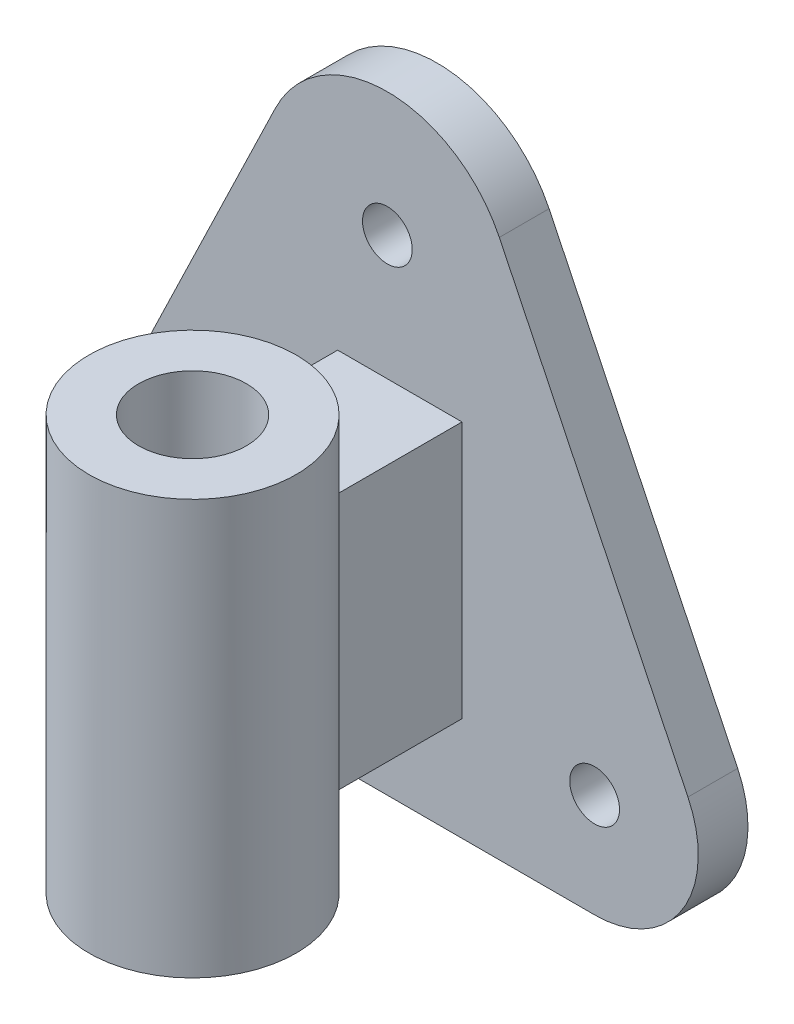
ISO-10303-21;
HEADER;
FILE_DESCRIPTION(('STEP AP214'),'2;1');
FILE_NAME('part.step','',(''),(''),'','','');
FILE_SCHEMA(('AUTOMOTIVE_DESIGN { 1 0 10303 214 1 1 1 1 }'));
ENDSEC;
DATA;
#1=APPLICATION_CONTEXT('core data for automotive mechanical design processes');
#2=APPLICATION_PROTOCOL_DEFINITION('international standard','automotive_design',2000,#1);
#3=PRODUCT_CONTEXT('',#1,'mechanical');
#4=PRODUCT('Part','Part','',(#3));
#5=PRODUCT_RELATED_PRODUCT_CATEGORY('part','',(#4));
#6=PRODUCT_DEFINITION_FORMATION('','',#4);
#7=PRODUCT_DEFINITION_CONTEXT('part definition',#1,'design');
#8=PRODUCT_DEFINITION('design','',#6,#7);
#9=PRODUCT_DEFINITION_SHAPE('','',#8);
#10=(LENGTH_UNIT() NAMED_UNIT(*) SI_UNIT(.MILLI.,.METRE.));
#11=(NAMED_UNIT(*) PLANE_ANGLE_UNIT() SI_UNIT($,.RADIAN.));
#12=(NAMED_UNIT(*) SI_UNIT($,.STERADIAN.) SOLID_ANGLE_UNIT());
#13=UNCERTAINTY_MEASURE_WITH_UNIT(LENGTH_MEASURE(1.E-05),#10,'distance_accuracy_value','');
#14=(GEOMETRIC_REPRESENTATION_CONTEXT(3) GLOBAL_UNCERTAINTY_ASSIGNED_CONTEXT((#13)) GLOBAL_UNIT_ASSIGNED_CONTEXT((#10,
#11,#12)) REPRESENTATION_CONTEXT('',''));
#15=CARTESIAN_POINT('',(0.,0.,0.));
#16=DIRECTION('',(0.,0.,1.));
#17=DIRECTION('',(1.,0.,0.));
#18=AXIS2_PLACEMENT_3D('',#15,#16,#17);
#19=CARTESIAN_POINT('',(0.,87.,0.));
#20=DIRECTION('',(0.,-1.,0.));
#21=DIRECTION('',(0.,0.,-1.));
#22=AXIS2_PLACEMENT_3D('',#19,#20,#21);
#23=PLANE('',#22);
#24=CARTESIAN_POINT('',(92.8513576072551,87.,62.));
#25=DIRECTION('',(0.,1.,0.));
#26=DIRECTION('',(0.,0.,1.));
#27=AXIS2_PLACEMENT_3D('',#24,#25,#26);
#28=CIRCLE('',#27,25.);
#29=CARTESIAN_POINT('',(107.851357607255,87.,42.));
#30=VERTEX_POINT('',#29);
#31=CARTESIAN_POINT('',(77.8513576072551,87.,42.));
#32=VERTEX_POINT('',#31);
#33=EDGE_CURVE('E135',#30,#32,#28,.T.);
#34=ORIENTED_EDGE('',*,*,#33,.F.);
#35=DIRECTION('',(0.,0.,-1.));
#36=VECTOR('',#35,1.);
#37=CARTESIAN_POINT('',(107.851357607255,87.,0.));
#38=LINE('',#37,#36);
#39=CARTESIAN_POINT('',(107.851357607255,87.,12.));
#40=VERTEX_POINT('',#39);
#41=EDGE_CURVE('E138',#30,#40,#38,.T.);
#42=ORIENTED_EDGE('',*,*,#41,.T.);
#43=DIRECTION('',(1.,0.,0.));
#44=VECTOR('',#43,1.);
#45=CARTESIAN_POINT('',(0.,87.,12.));
#46=LINE('',#45,#44);
#47=CARTESIAN_POINT('',(77.8513576072551,87.,12.));
#48=VERTEX_POINT('',#47);
#49=EDGE_CURVE('E73',#48,#40,#46,.T.);
#50=ORIENTED_EDGE('',*,*,#49,.F.);
#51=DIRECTION('',(0.,0.,-1.));
#52=VECTOR('',#51,1.);
#53=CARTESIAN_POINT('',(77.8513576072551,87.,0.));
#54=LINE('',#53,#52);
#55=EDGE_CURVE('E132',#32,#48,#54,.T.);
#56=ORIENTED_EDGE('',*,*,#55,.F.);
#57=EDGE_LOOP('',(#34,#42,#50,#56));
#58=FACE_BOUND('',#57,.T.);
#59=ADVANCED_FACE('F58',(#58),#23,.F.);
#60=CARTESIAN_POINT('',(0.,25.,0.));
#61=DIRECTION('',(0.,-1.,0.));
#62=DIRECTION('',(0.,0.,-1.));
#63=AXIS2_PLACEMENT_3D('',#60,#61,#62);
#64=PLANE('',#63);
#65=DIRECTION('',(0.,0.,-1.));
#66=VECTOR('',#65,1.);
#67=CARTESIAN_POINT('',(107.851357607255,25.,0.));
#68=LINE('',#67,#66);
#69=CARTESIAN_POINT('',(107.851357607255,25.,42.));
#70=VERTEX_POINT('',#69);
#71=CARTESIAN_POINT('',(107.851357607255,25.,12.));
#72=VERTEX_POINT('',#71);
#73=EDGE_CURVE('E168',#70,#72,#68,.T.);
#74=ORIENTED_EDGE('',*,*,#73,.F.);
#75=CARTESIAN_POINT('',(92.8513576072551,25.,62.));
#76=DIRECTION('',(0.,-1.,0.));
#77=DIRECTION('',(0.,0.,-1.));
#78=AXIS2_PLACEMENT_3D('',#75,#76,#77);
#79=CIRCLE('',#78,25.);
#80=CARTESIAN_POINT('',(77.8513576072551,25.,42.));
#81=VERTEX_POINT('',#80);
#82=EDGE_CURVE('E164',#81,#70,#79,.T.);
#83=ORIENTED_EDGE('',*,*,#82,.F.);
#84=DIRECTION('',(0.,0.,-1.));
#85=VECTOR('',#84,1.);
#86=CARTESIAN_POINT('',(77.8513576072551,25.,0.));
#87=LINE('',#86,#85);
#88=CARTESIAN_POINT('',(77.8513576072551,25.,12.));
#89=VERTEX_POINT('',#88);
#90=EDGE_CURVE('E145',#81,#89,#87,.T.);
#91=ORIENTED_EDGE('',*,*,#90,.T.);
#92=DIRECTION('',(1.,0.,0.));
#93=VECTOR('',#92,1.);
#94=CARTESIAN_POINT('',(0.,25.,12.));
#95=LINE('',#94,#93);
#96=EDGE_CURVE('E170',#89,#72,#95,.T.);
#97=ORIENTED_EDGE('',*,*,#96,.T.);
#98=EDGE_LOOP('',(#74,#83,#91,#97));
#99=FACE_BOUND('',#98,.T.);
#100=ADVANCED_FACE('F284',(#99),#64,.T.);
#101=CARTESIAN_POINT('',(139.842699598597,25.,12.));
#102=DIRECTION('',(0.,0.,1.));
#103=DIRECTION('',(1.,0.,0.));
#104=AXIS2_PLACEMENT_3D('',#101,#102,#103);
#105=PLANE('',#104);
#106=CARTESIAN_POINT('',(89.8426995985971,117.,12.));
#107=DIRECTION('',(0.,0.,1.));
#108=DIRECTION('',(1.,0.,0.));
#109=AXIS2_PLACEMENT_3D('',#106,#107,#108);
#110=CIRCLE('',#109,6.);
#111=CARTESIAN_POINT('',(95.8426995985971,117.,12.));
#112=VERTEX_POINT('',#111);
#113=EDGE_CURVE('E189',#112,#112,#110,.T.);
#114=ORIENTED_EDGE('',*,*,#113,.F.);
#115=EDGE_LOOP('',(#114));
#116=FACE_BOUND('',#115,.T.);
#117=CARTESIAN_POINT('',(139.842699598597,25.,12.));
#118=DIRECTION('',(0.,0.,1.));
#119=DIRECTION('',(1.,0.,0.));
#120=AXIS2_PLACEMENT_3D('',#117,#118,#119);
#121=CIRCLE('',#120,25.);
#122=CARTESIAN_POINT('',(139.842699598597,0.,12.));
#123=VERTEX_POINT('',#122);
#124=CARTESIAN_POINT('',(162.353302591837,35.8753277137172,12.));
#125=VERTEX_POINT('',#124);
#126=EDGE_CURVE('E201',#123,#125,#121,.T.);
#127=ORIENTED_EDGE('',*,*,#126,.T.);
#128=DIRECTION('',(-0.43501310854869,0.900424119729589,0.));
#129=VECTOR('',#128,1.);
#130=CARTESIAN_POINT('',(116.855423190485,130.050393256461,12.));
#131=LINE('',#130,#129);
#132=CARTESIAN_POINT('',(116.855423190485,130.050393256461,12.));
#133=VERTEX_POINT('',#132);
#134=EDGE_CURVE('E204',#125,#133,#131,.T.);
#135=ORIENTED_EDGE('',*,*,#134,.T.);
#136=CARTESIAN_POINT('',(89.8426995985971,117.,12.));
#137=DIRECTION('',(0.,0.,1.));
#138=DIRECTION('',(1.,0.,0.));
#139=AXIS2_PLACEMENT_3D('',#136,#137,#138);
#140=CIRCLE('',#139,30.);
#141=CARTESIAN_POINT('',(62.8299760067094,130.050393256461,12.));
#142=VERTEX_POINT('',#141);
#143=EDGE_CURVE('E207',#133,#142,#140,.T.);
#144=ORIENTED_EDGE('',*,*,#143,.T.);
#145=DIRECTION('',(-0.43501310854869,-0.900424119729589,0.));
#146=VECTOR('',#145,1.);
#147=CARTESIAN_POINT('',(17.3320966053574,35.8753277137172,12.));
#148=LINE('',#147,#146);
#149=CARTESIAN_POINT('',(17.3320966053574,35.8753277137172,12.));
#150=VERTEX_POINT('',#149);
#151=EDGE_CURVE('E209',#142,#150,#148,.T.);
#152=ORIENTED_EDGE('',*,*,#151,.T.);
#153=CARTESIAN_POINT('',(39.8426995985971,25.,12.));
#154=DIRECTION('',(0.,0.,1.));
#155=DIRECTION('',(-1.,0.,0.));
#156=AXIS2_PLACEMENT_3D('',#153,#154,#155);
#157=CIRCLE('',#156,25.);
#158=CARTESIAN_POINT('',(39.8426995985971,0.,12.));
#159=VERTEX_POINT('',#158);
#160=EDGE_CURVE('E211',#150,#159,#157,.T.);
#161=ORIENTED_EDGE('',*,*,#160,.T.);
#162=DIRECTION('',(1.,0.,0.));
#163=VECTOR('',#162,1.);
#164=CARTESIAN_POINT('',(39.8426995985971,0.,12.));
#165=LINE('',#164,#163);
#166=EDGE_CURVE('E213',#159,#123,#165,.T.);
#167=ORIENTED_EDGE('',*,*,#166,.T.);
#168=EDGE_LOOP('',(#127,#135,#144,#152,#161,#167));
#169=FACE_BOUND('',#168,.T.);
#170=CARTESIAN_POINT('',(39.8426995985971,25.,12.));
#171=DIRECTION('',(0.,0.,1.));
#172=DIRECTION('',(1.,0.,0.));
#173=AXIS2_PLACEMENT_3D('',#170,#171,#172);
#174=CIRCLE('',#173,6.);
#175=CARTESIAN_POINT('',(45.8426995985971,25.,12.));
#176=VERTEX_POINT('',#175);
#177=EDGE_CURVE('E195',#176,#176,#174,.T.);
#178=ORIENTED_EDGE('',*,*,#177,.F.);
#179=EDGE_LOOP('',(#178));
#180=FACE_BOUND('',#179,.T.);
#181=CARTESIAN_POINT('',(139.842699598597,25.,12.));
#182=DIRECTION('',(0.,0.,1.));
#183=DIRECTION('',(1.,0.,0.));
#184=AXIS2_PLACEMENT_3D('',#181,#182,#183);
#185=CIRCLE('',#184,6.00000000000002);
#186=CARTESIAN_POINT('',(145.842699598597,25.,12.));
#187=VERTEX_POINT('',#186);
#188=EDGE_CURVE('E183',#187,#187,#185,.T.);
#189=ORIENTED_EDGE('',*,*,#188,.F.);
#190=EDGE_LOOP('',(#189));
#191=FACE_BOUND('',#190,.T.);
#192=DIRECTION('',(0.,-1.,0.));
#193=VECTOR('',#192,1.);
#194=CARTESIAN_POINT('',(77.8513576072551,87.,12.));
#195=LINE('',#194,#193);
#196=EDGE_CURVE('E78',#48,#89,#195,.T.);
#197=ORIENTED_EDGE('',*,*,#196,.F.);
#198=ORIENTED_EDGE('',*,*,#49,.T.);
#199=DIRECTION('',(0.,-1.,0.));
#200=VECTOR('',#199,1.);
#201=CARTESIAN_POINT('',(107.851357607255,87.,12.));
#202=LINE('',#201,#200);
#203=EDGE_CURVE('E178',#40,#72,#202,.T.);
#204=ORIENTED_EDGE('',*,*,#203,.T.);
#205=ORIENTED_EDGE('',*,*,#96,.F.);
#206=EDGE_LOOP('',(#197,#198,#204,#205));
#207=FACE_BOUND('',#206,.T.);
#208=ADVANCED_FACE('F262',(#116,#169,#180,#191,#207),#105,.T.);
#209=CARTESIAN_POINT('',(139.842699598597,25.,0.));
#210=DIRECTION('',(0.,0.,1.));
#211=DIRECTION('',(1.,0.,0.));
#212=AXIS2_PLACEMENT_3D('',#209,#210,#211);
#213=PLANE('',#212);
#214=CARTESIAN_POINT('',(139.842699598597,25.,0.));
#215=DIRECTION('',(0.,0.,1.));
#216=DIRECTION('',(1.,0.,0.));
#217=AXIS2_PLACEMENT_3D('',#214,#215,#216);
#218=CIRCLE('',#217,25.);
#219=CARTESIAN_POINT('',(139.842699598597,0.,0.));
#220=VERTEX_POINT('',#219);
#221=CARTESIAN_POINT('',(162.353302591837,35.8753277137172,0.));
#222=VERTEX_POINT('',#221);
#223=EDGE_CURVE('E198',#220,#222,#218,.T.);
#224=ORIENTED_EDGE('',*,*,#223,.F.);
#225=DIRECTION('',(1.,0.,0.));
#226=VECTOR('',#225,1.);
#227=CARTESIAN_POINT('',(39.8426995985971,0.,0.));
#228=LINE('',#227,#226);
#229=CARTESIAN_POINT('',(39.8426995985971,0.,0.));
#230=VERTEX_POINT('',#229);
#231=EDGE_CURVE('E205',#230,#220,#228,.T.);
#232=ORIENTED_EDGE('',*,*,#231,.F.);
#233=CARTESIAN_POINT('',(39.8426995985971,25.,0.));
#234=DIRECTION('',(0.,0.,1.));
#235=DIRECTION('',(-1.,0.,0.));
#236=AXIS2_PLACEMENT_3D('',#233,#234,#235);
#237=CIRCLE('',#236,25.);
#238=CARTESIAN_POINT('',(17.3320966053574,35.8753277137172,0.));
#239=VERTEX_POINT('',#238);
#240=EDGE_CURVE('E224',#239,#230,#237,.T.);
#241=ORIENTED_EDGE('',*,*,#240,.F.);
#242=DIRECTION('',(-0.43501310854869,-0.900424119729589,0.));
#243=VECTOR('',#242,1.);
#244=CARTESIAN_POINT('',(17.3320966053574,35.8753277137172,0.));
#245=LINE('',#244,#243);
#246=CARTESIAN_POINT('',(62.8299760067094,130.050393256461,0.));
#247=VERTEX_POINT('',#246);
#248=EDGE_CURVE('E222',#247,#239,#245,.T.);
#249=ORIENTED_EDGE('',*,*,#248,.F.);
#250=CARTESIAN_POINT('',(89.8426995985971,117.,0.));
#251=DIRECTION('',(0.,0.,1.));
#252=DIRECTION('',(1.,0.,0.));
#253=AXIS2_PLACEMENT_3D('',#250,#251,#252);
#254=CIRCLE('',#253,30.);
#255=CARTESIAN_POINT('',(116.855423190485,130.050393256461,0.));
#256=VERTEX_POINT('',#255);
#257=EDGE_CURVE('E220',#256,#247,#254,.T.);
#258=ORIENTED_EDGE('',*,*,#257,.F.);
#259=DIRECTION('',(-0.43501310854869,0.900424119729589,0.));
#260=VECTOR('',#259,1.);
#261=CARTESIAN_POINT('',(116.855423190485,130.050393256461,0.));
#262=LINE('',#261,#260);
#263=EDGE_CURVE('E218',#222,#256,#262,.T.);
#264=ORIENTED_EDGE('',*,*,#263,.F.);
#265=EDGE_LOOP('',(#224,#232,#241,#249,#258,#264));
#266=FACE_BOUND('',#265,.T.);
#267=CARTESIAN_POINT('',(39.8426995985971,25.,0.));
#268=DIRECTION('',(0.,0.,1.));
#269=DIRECTION('',(1.,0.,0.));
#270=AXIS2_PLACEMENT_3D('',#267,#268,#269);
#271=CIRCLE('',#270,6.);
#272=CARTESIAN_POINT('',(45.8426995985971,25.,0.));
#273=VERTEX_POINT('',#272);
#274=EDGE_CURVE('E192',#273,#273,#271,.T.);
#275=ORIENTED_EDGE('',*,*,#274,.T.);
#276=EDGE_LOOP('',(#275));
#277=FACE_BOUND('',#276,.T.);
#278=CARTESIAN_POINT('',(89.8426995985971,117.,0.));
#279=DIRECTION('',(0.,0.,1.));
#280=DIRECTION('',(1.,0.,0.));
#281=AXIS2_PLACEMENT_3D('',#278,#279,#280);
#282=CIRCLE('',#281,6.);
#283=CARTESIAN_POINT('',(95.8426995985971,117.,0.));
#284=VERTEX_POINT('',#283);
#285=EDGE_CURVE('E186',#284,#284,#282,.T.);
#286=ORIENTED_EDGE('',*,*,#285,.T.);
#287=EDGE_LOOP('',(#286));
#288=FACE_BOUND('',#287,.T.);
#289=CARTESIAN_POINT('',(139.842699598597,25.,0.));
#290=DIRECTION('',(0.,0.,1.));
#291=DIRECTION('',(1.,0.,0.));
#292=AXIS2_PLACEMENT_3D('',#289,#290,#291);
#293=CIRCLE('',#292,6.00000000000002);
#294=CARTESIAN_POINT('',(145.842699598597,25.,0.));
#295=VERTEX_POINT('',#294);
#296=EDGE_CURVE('E180',#295,#295,#293,.T.);
#297=ORIENTED_EDGE('',*,*,#296,.T.);
#298=EDGE_LOOP('',(#297));
#299=FACE_BOUND('',#298,.T.);
#300=ADVANCED_FACE('F248',(#266,#277,#288,#299),#213,.F.);
#301=CARTESIAN_POINT('',(139.842699598597,25.,12.));
#302=DIRECTION('',(0.,0.,-1.));
#303=DIRECTION('',(-1.,0.,0.));
#304=AXIS2_PLACEMENT_3D('',#301,#302,#303);
#305=CYLINDRICAL_SURFACE('',#304,25.);
#306=ORIENTED_EDGE('',*,*,#223,.T.);
#307=DIRECTION('',(0.,0.,-1.));
#308=VECTOR('',#307,1.);
#309=CARTESIAN_POINT('',(162.353302591837,35.8753277137172,12.));
#310=LINE('',#309,#308);
#311=EDGE_CURVE('E12',#125,#222,#310,.T.);
#312=ORIENTED_EDGE('',*,*,#311,.F.);
#313=ORIENTED_EDGE('',*,*,#126,.F.);
#314=DIRECTION('',(0.,0.,-1.));
#315=VECTOR('',#314,1.);
#316=CARTESIAN_POINT('',(139.842699598597,0.,12.));
#317=LINE('',#316,#315);
#318=EDGE_CURVE('E215',#123,#220,#317,.T.);
#319=ORIENTED_EDGE('',*,*,#318,.T.);
#320=EDGE_LOOP('',(#306,#312,#313,#319));
#321=FACE_BOUND('',#320,.T.);
#322=ADVANCED_FACE('F60',(#321),#305,.T.);
#323=CARTESIAN_POINT('',(116.855423190485,130.050393256461,12.));
#324=DIRECTION('',(-0.900424119729589,-0.43501310854869,0.));
#325=DIRECTION('',(0.43501310854869,-0.90042411972959,0.));
#326=AXIS2_PLACEMENT_3D('',#323,#324,#325);
#327=PLANE('',#326);
#328=ORIENTED_EDGE('',*,*,#263,.T.);
#329=DIRECTION('',(0.,0.,-1.));
#330=VECTOR('',#329,1.);
#331=CARTESIAN_POINT('',(116.855423190485,130.050393256461,12.));
#332=LINE('',#331,#330);
#333=EDGE_CURVE('E66',#133,#256,#332,.T.);
#334=ORIENTED_EDGE('',*,*,#333,.F.);
#335=ORIENTED_EDGE('',*,*,#134,.F.);
#336=ORIENTED_EDGE('',*,*,#311,.T.);
#337=EDGE_LOOP('',(#328,#334,#335,#336));
#338=FACE_BOUND('',#337,.T.);
#339=ADVANCED_FACE('F267',(#338),#327,.F.);
#340=CARTESIAN_POINT('',(89.8426995985971,117.,12.));
#341=DIRECTION('',(0.,0.,-1.));
#342=DIRECTION('',(-1.,0.,0.));
#343=AXIS2_PLACEMENT_3D('',#340,#341,#342);
#344=CYLINDRICAL_SURFACE('',#343,30.);
#345=ORIENTED_EDGE('',*,*,#257,.T.);
#346=DIRECTION('',(0.,0.,-1.));
#347=VECTOR('',#346,1.);
#348=CARTESIAN_POINT('',(62.8299760067094,130.050393256461,12.));
#349=LINE('',#348,#347);
#350=EDGE_CURVE('E235',#142,#247,#349,.T.);
#351=ORIENTED_EDGE('',*,*,#350,.F.);
#352=ORIENTED_EDGE('',*,*,#143,.F.);
#353=ORIENTED_EDGE('',*,*,#333,.T.);
#354=EDGE_LOOP('',(#345,#351,#352,#353));
#355=FACE_BOUND('',#354,.T.);
#356=ADVANCED_FACE('F242',(#355),#344,.T.);
#357=CARTESIAN_POINT('',(17.3320966053574,35.8753277137172,12.));
#358=DIRECTION('',(0.900424119729589,-0.43501310854869,0.));
#359=DIRECTION('',(0.43501310854869,0.900424119729589,0.));
#360=AXIS2_PLACEMENT_3D('',#357,#358,#359);
#361=PLANE('',#360);
#362=ORIENTED_EDGE('',*,*,#248,.T.);
#363=DIRECTION('',(0.,0.,-1.));
#364=VECTOR('',#363,1.);
#365=CARTESIAN_POINT('',(17.3320966053574,35.8753277137172,12.));
#366=LINE('',#365,#364);
#367=EDGE_CURVE('E232',#150,#239,#366,.T.);
#368=ORIENTED_EDGE('',*,*,#367,.F.);
#369=ORIENTED_EDGE('',*,*,#151,.F.);
#370=ORIENTED_EDGE('',*,*,#350,.T.);
#371=EDGE_LOOP('',(#362,#368,#369,#370));
#372=FACE_BOUND('',#371,.T.);
#373=ADVANCED_FACE('F254',(#372),#361,.F.);
#374=CARTESIAN_POINT('',(39.8426995985971,25.,12.));
#375=DIRECTION('',(0.,0.,-1.));
#376=DIRECTION('',(-1.,0.,0.));
#377=AXIS2_PLACEMENT_3D('',#374,#375,#376);
#378=CYLINDRICAL_SURFACE('',#377,25.);
#379=ORIENTED_EDGE('',*,*,#240,.T.);
#380=DIRECTION('',(0.,0.,-1.));
#381=VECTOR('',#380,1.);
#382=CARTESIAN_POINT('',(39.8426995985971,0.,12.));
#383=LINE('',#382,#381);
#384=EDGE_CURVE('E229',#159,#230,#383,.T.);
#385=ORIENTED_EDGE('',*,*,#384,.F.);
#386=ORIENTED_EDGE('',*,*,#160,.F.);
#387=ORIENTED_EDGE('',*,*,#367,.T.);
#388=EDGE_LOOP('',(#379,#385,#386,#387));
#389=FACE_BOUND('',#388,.T.);
#390=ADVANCED_FACE('F258',(#389),#378,.T.);
#391=CARTESIAN_POINT('',(39.8426995985971,0.,12.));
#392=DIRECTION('',(0.,1.,0.));
#393=DIRECTION('',(0.,0.,1.));
#394=AXIS2_PLACEMENT_3D('',#391,#392,#393);
#395=PLANE('',#394);
#396=ORIENTED_EDGE('',*,*,#231,.T.);
#397=ORIENTED_EDGE('',*,*,#318,.F.);
#398=ORIENTED_EDGE('',*,*,#166,.F.);
#399=ORIENTED_EDGE('',*,*,#384,.T.);
#400=EDGE_LOOP('',(#396,#397,#398,#399));
#401=FACE_BOUND('',#400,.T.);
#402=ADVANCED_FACE('F270',(#401),#395,.F.);
#403=CARTESIAN_POINT('',(39.8426995985971,25.,12.));
#404=DIRECTION('',(0.,0.,-1.));
#405=DIRECTION('',(-1.,0.,0.));
#406=AXIS2_PLACEMENT_3D('',#403,#404,#405);
#407=CYLINDRICAL_SURFACE('',#406,6.);
#408=ORIENTED_EDGE('',*,*,#177,.T.);
#409=EDGE_LOOP('',(#408));
#410=FACE_BOUND('',#409,.T.);
#411=ORIENTED_EDGE('',*,*,#274,.F.);
#412=EDGE_LOOP('',(#411));
#413=FACE_BOUND('',#412,.T.);
#414=ADVANCED_FACE('F272',(#410,#413),#407,.F.);
#415=CARTESIAN_POINT('',(89.8426995985971,117.,12.));
#416=DIRECTION('',(0.,0.,-1.));
#417=DIRECTION('',(-1.,0.,0.));
#418=AXIS2_PLACEMENT_3D('',#415,#416,#417);
#419=CYLINDRICAL_SURFACE('',#418,6.);
#420=ORIENTED_EDGE('',*,*,#113,.T.);
#421=EDGE_LOOP('',(#420));
#422=FACE_BOUND('',#421,.T.);
#423=ORIENTED_EDGE('',*,*,#285,.F.);
#424=EDGE_LOOP('',(#423));
#425=FACE_BOUND('',#424,.T.);
#426=ADVANCED_FACE('F278',(#422,#425),#419,.F.);
#427=CARTESIAN_POINT('',(139.842699598597,25.,12.));
#428=DIRECTION('',(0.,0.,-1.));
#429=DIRECTION('',(-1.,0.,0.));
#430=AXIS2_PLACEMENT_3D('',#427,#428,#429);
#431=CYLINDRICAL_SURFACE('',#430,6.00000000000002);
#432=ORIENTED_EDGE('',*,*,#188,.T.);
#433=EDGE_LOOP('',(#432));
#434=FACE_BOUND('',#433,.T.);
#435=ORIENTED_EDGE('',*,*,#296,.F.);
#436=EDGE_LOOP('',(#435));
#437=FACE_BOUND('',#436,.T.);
#438=ADVANCED_FACE('F303',(#434,#437),#431,.F.);
#439=CARTESIAN_POINT('',(107.851357607255,87.,0.));
#440=DIRECTION('',(-1.,0.,0.));
#441=DIRECTION('',(0.,0.,1.));
#442=AXIS2_PLACEMENT_3D('',#439,#440,#441);
#443=PLANE('',#442);
#444=ORIENTED_EDGE('',*,*,#73,.T.);
#445=ORIENTED_EDGE('',*,*,#203,.F.);
#446=ORIENTED_EDGE('',*,*,#41,.F.);
#447=DIRECTION('',(0.,-1.,0.));
#448=VECTOR('',#447,1.);
#449=CARTESIAN_POINT('',(107.851357607255,87.,42.));
#450=LINE('',#449,#448);
#451=EDGE_CURVE('E147',#30,#70,#450,.T.);
#452=ORIENTED_EDGE('',*,*,#451,.T.);
#453=EDGE_LOOP('',(#444,#445,#446,#452));
#454=FACE_BOUND('',#453,.T.);
#455=ADVANCED_FACE('F299',(#454),#443,.F.);
#456=CARTESIAN_POINT('',(77.8513576072551,87.,0.));
#457=DIRECTION('',(-1.,0.,0.));
#458=DIRECTION('',(0.,0.,1.));
#459=AXIS2_PLACEMENT_3D('',#456,#457,#458);
#460=PLANE('',#459);
#461=ORIENTED_EDGE('',*,*,#90,.F.);
#462=DIRECTION('',(0.,-1.,0.));
#463=VECTOR('',#462,1.);
#464=CARTESIAN_POINT('',(77.8513576072551,87.,42.));
#465=LINE('',#464,#463);
#466=EDGE_CURVE('E142',#32,#81,#465,.T.);
#467=ORIENTED_EDGE('',*,*,#466,.F.);
#468=ORIENTED_EDGE('',*,*,#55,.T.);
#469=ORIENTED_EDGE('',*,*,#196,.T.);
#470=EDGE_LOOP('',(#461,#467,#468,#469));
#471=FACE_BOUND('',#470,.T.);
#472=ADVANCED_FACE('F143',(#471),#460,.T.);
#473=CARTESIAN_POINT('',(92.8513576072551,87.,62.));
#474=DIRECTION('',(0.,-1.,0.));
#475=DIRECTION('',(0.,0.,-1.));
#476=AXIS2_PLACEMENT_3D('',#473,#474,#475);
#477=CYLINDRICAL_SURFACE('',#476,25.);
#478=ORIENTED_EDGE('',*,*,#466,.T.);
#479=ORIENTED_EDGE('',*,*,#82,.T.);
#480=ORIENTED_EDGE('',*,*,#451,.F.);
#481=ORIENTED_EDGE('',*,*,#33,.T.);
#482=EDGE_LOOP('',(#478,#479,#480,#481));
#483=FACE_BOUND('',#482,.T.);
#484=CARTESIAN_POINT('',(92.8513576072551,6.,62.));
#485=DIRECTION('',(0.,-1.,0.));
#486=DIRECTION('',(0.,0.,-1.));
#487=AXIS2_PLACEMENT_3D('',#484,#485,#486);
#488=CIRCLE('',#487,25.);
#489=CARTESIAN_POINT('',(92.8513576072551,6.,37.));
#490=VERTEX_POINT('',#489);
#491=EDGE_CURVE('E165',#490,#490,#488,.T.);
#492=ORIENTED_EDGE('',*,*,#491,.F.);
#493=EDGE_LOOP('',(#492));
#494=FACE_BOUND('',#493,.T.);
#495=CARTESIAN_POINT('',(92.8513576072551,106.,62.));
#496=DIRECTION('',(0.,1.,0.));
#497=DIRECTION('',(0.,0.,1.));
#498=AXIS2_PLACEMENT_3D('',#495,#496,#497);
#499=CIRCLE('',#498,25.);
#500=CARTESIAN_POINT('',(92.8513576072551,106.,87.));
#501=VERTEX_POINT('',#500);
#502=EDGE_CURVE('E153',#501,#501,#499,.T.);
#503=ORIENTED_EDGE('',*,*,#502,.F.);
#504=EDGE_LOOP('',(#503));
#505=FACE_BOUND('',#504,.T.);
#506=ADVANCED_FACE('F149',(#483,#494,#505),#477,.T.);
#507=CARTESIAN_POINT('',(92.8513576072551,87.,62.));
#508=DIRECTION('',(0.,-1.,0.));
#509=DIRECTION('',(0.,0.,-1.));
#510=AXIS2_PLACEMENT_3D('',#507,#508,#509);
#511=CYLINDRICAL_SURFACE('',#510,13.);
#512=CARTESIAN_POINT('',(92.8513576072551,6.,62.));
#513=DIRECTION('',(0.,-1.,0.));
#514=DIRECTION('',(0.,0.,-1.));
#515=AXIS2_PLACEMENT_3D('',#512,#513,#514);
#516=CIRCLE('',#515,13.);
#517=CARTESIAN_POINT('',(92.8513576072551,6.,49.));
#518=VERTEX_POINT('',#517);
#519=EDGE_CURVE('E157',#518,#518,#516,.T.);
#520=ORIENTED_EDGE('',*,*,#519,.T.);
#521=EDGE_LOOP('',(#520));
#522=FACE_BOUND('',#521,.T.);
#523=CARTESIAN_POINT('',(92.8513576072551,106.,62.));
#524=DIRECTION('',(0.,1.,0.));
#525=DIRECTION('',(0.,0.,1.));
#526=AXIS2_PLACEMENT_3D('',#523,#524,#525);
#527=CIRCLE('',#526,13.);
#528=CARTESIAN_POINT('',(92.8513576072551,106.,75.));
#529=VERTEX_POINT('',#528);
#530=EDGE_CURVE('E154',#529,#529,#527,.T.);
#531=ORIENTED_EDGE('',*,*,#530,.T.);
#532=EDGE_LOOP('',(#531));
#533=FACE_BOUND('',#532,.T.);
#534=ADVANCED_FACE('F294',(#522,#533),#511,.F.);
#535=CARTESIAN_POINT('',(92.8513576072551,6.,62.));
#536=DIRECTION('',(0.,-1.,0.));
#537=DIRECTION('',(0.,0.,-1.));
#538=AXIS2_PLACEMENT_3D('',#535,#536,#537);
#539=PLANE('',#538);
#540=ORIENTED_EDGE('',*,*,#491,.T.);
#541=EDGE_LOOP('',(#540));
#542=FACE_BOUND('',#541,.T.);
#543=ORIENTED_EDGE('',*,*,#519,.F.);
#544=EDGE_LOOP('',(#543));
#545=FACE_BOUND('',#544,.T.);
#546=ADVANCED_FACE('F379',(#542,#545),#539,.T.);
#547=CARTESIAN_POINT('',(92.8513576072551,106.,62.));
#548=DIRECTION('',(0.,1.,0.));
#549=DIRECTION('',(0.,0.,1.));
#550=AXIS2_PLACEMENT_3D('',#547,#548,#549);
#551=PLANE('',#550);
#552=ORIENTED_EDGE('',*,*,#502,.T.);
#553=EDGE_LOOP('',(#552));
#554=FACE_BOUND('',#553,.T.);
#555=ORIENTED_EDGE('',*,*,#530,.F.);
#556=EDGE_LOOP('',(#555));
#557=FACE_BOUND('',#556,.T.);
#558=ADVANCED_FACE('F383',(#554,#557),#551,.T.);
#559=CLOSED_SHELL('',(#59,#100,#208,#300,#322,#339,#356,#373,#390,#402,#414,#426,#438,#455,#472,
#506,#534,#546,#558));
#560=MANIFOLD_SOLID_BREP('B2',#559);
#561=ADVANCED_BREP_SHAPE_REPRESENTATION('',(#18,#560),#14);
#562=SHAPE_DEFINITION_REPRESENTATION(#9,#561);
ENDSEC;
END-ISO-10303-21;
